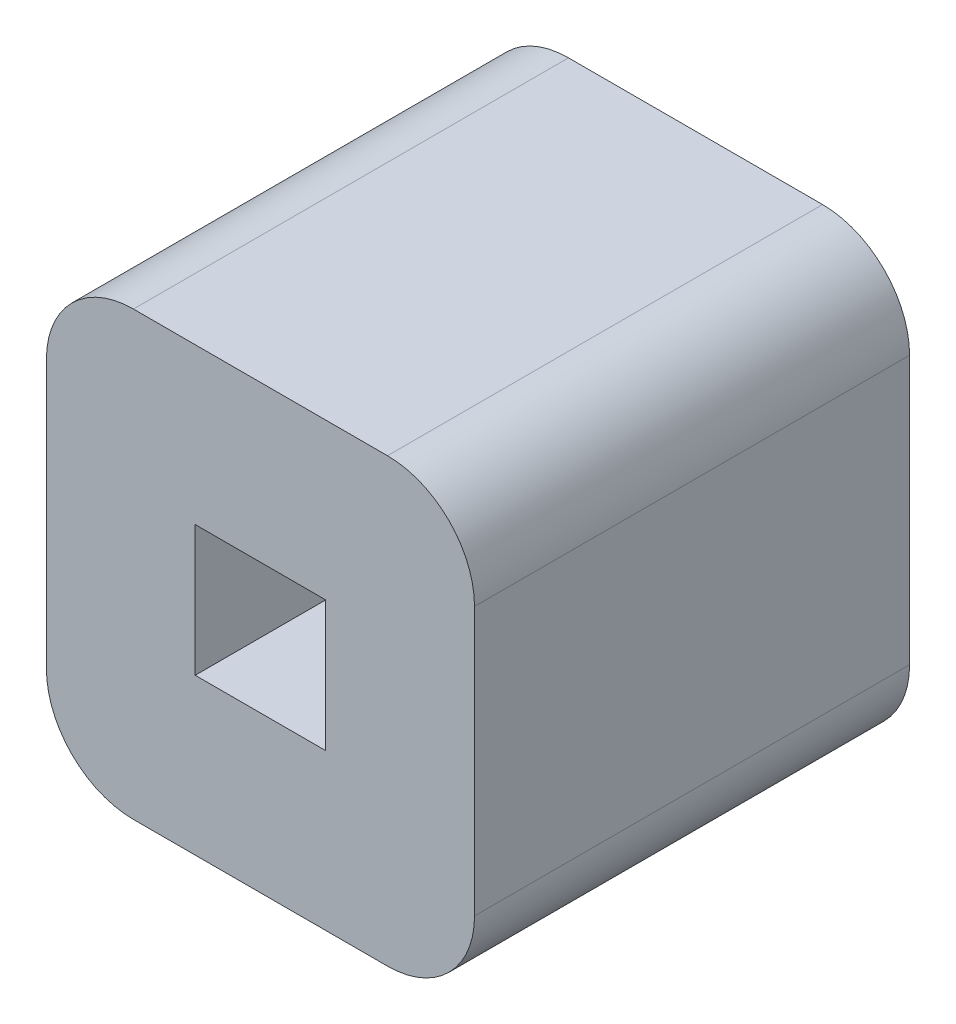
ISO-10303-21;
HEADER;
FILE_DESCRIPTION(('STEP AP214'),'2;1');
FILE_NAME('part.step','',(''),(''),'','','');
FILE_SCHEMA(('AUTOMOTIVE_DESIGN { 1 0 10303 214 1 1 1 1 }'));
ENDSEC;
DATA;
#1=APPLICATION_CONTEXT('core data for automotive mechanical design processes');
#2=APPLICATION_PROTOCOL_DEFINITION('international standard','automotive_design',2000,#1);
#3=PRODUCT_CONTEXT('',#1,'mechanical');
#4=PRODUCT('Part','Part','',(#3));
#5=PRODUCT_RELATED_PRODUCT_CATEGORY('part','',(#4));
#6=PRODUCT_DEFINITION_FORMATION('','',#4);
#7=PRODUCT_DEFINITION_CONTEXT('part definition',#1,'design');
#8=PRODUCT_DEFINITION('design','',#6,#7);
#9=PRODUCT_DEFINITION_SHAPE('','',#8);
#10=(LENGTH_UNIT() NAMED_UNIT(*) SI_UNIT(.MILLI.,.METRE.));
#11=(NAMED_UNIT(*) PLANE_ANGLE_UNIT() SI_UNIT($,.RADIAN.));
#12=(NAMED_UNIT(*) SI_UNIT($,.STERADIAN.) SOLID_ANGLE_UNIT());
#13=UNCERTAINTY_MEASURE_WITH_UNIT(LENGTH_MEASURE(1.E-05),#10,'distance_accuracy_value','');
#14=(GEOMETRIC_REPRESENTATION_CONTEXT(3) GLOBAL_UNCERTAINTY_ASSIGNED_CONTEXT((#13)) GLOBAL_UNIT_ASSIGNED_CONTEXT((#10,
#11,#12)) REPRESENTATION_CONTEXT('',''));
#15=CARTESIAN_POINT('',(0.,0.,0.));
#16=DIRECTION('',(0.,0.,1.));
#17=DIRECTION('',(1.,0.,0.));
#18=AXIS2_PLACEMENT_3D('',#15,#16,#17);
#19=CARTESIAN_POINT('',(1.5403288535176,-0.579832143277619,0.16340157480315));
#20=DIRECTION('',(0.,0.,-1.));
#21=DIRECTION('',(-1.,0.,0.));
#22=AXIS2_PLACEMENT_3D('',#19,#20,#21);
#23=PLANE('',#22);
#24=CARTESIAN_POINT('',(1.41080129446248,-0.565147103907541,0.16340157480315));
#25=DIRECTION('',(0.,0.,1.));
#26=DIRECTION('',(1.,0.,0.));
#27=AXIS2_PLACEMENT_3D('',#24,#25,#26);
#28=CIRCLE('',#27,0.0196850393700787);
#29=CARTESIAN_POINT('',(1.43048633383256,-0.565147103907541,0.16340157480315));
#30=VERTEX_POINT('',#29);
#31=CARTESIAN_POINT('',(1.41080129446248,-0.58483214327762,0.16340157480315));
#32=VERTEX_POINT('',#31);
#33=EDGE_CURVE('E159',#30,#32,#28,.F.);
#34=ORIENTED_EDGE('',*,*,#33,.F.);
#35=DIRECTION('',(0.,-1.,0.));
#36=VECTOR('',#35,1.);
#37=CARTESIAN_POINT('',(1.43048633383256,-0.501485686584706,0.16340157480315));
#38=LINE('',#37,#36);
#39=CARTESIAN_POINT('',(1.43048633383256,-0.504517182647699,0.16340157480315));
#40=VERTEX_POINT('',#39);
#41=EDGE_CURVE('E134',#30,#40,#38,.F.);
#42=ORIENTED_EDGE('',*,*,#41,.T.);
#43=CARTESIAN_POINT('',(1.41080129446248,-0.504517182647699,0.16340157480315));
#44=DIRECTION('',(0.,0.,1.));
#45=DIRECTION('',(1.,0.,0.));
#46=AXIS2_PLACEMENT_3D('',#43,#44,#45);
#47=CIRCLE('',#46,0.0196850393700787);
#48=CARTESIAN_POINT('',(1.41080129446248,-0.48483214327762,0.16340157480315));
#49=VERTEX_POINT('',#48);
#50=EDGE_CURVE('E137',#49,#40,#47,.F.);
#51=ORIENTED_EDGE('',*,*,#50,.F.);
#52=DIRECTION('',(1.,0.,0.));
#53=VECTOR('',#52,1.);
#54=CARTESIAN_POINT('',(1.24544696375382,-0.48483214327762,0.16340157480315));
#55=LINE('',#54,#53);
#56=CARTESIAN_POINT('',(1.35332097950185,-0.48483214327762,0.16340157480315));
#57=VERTEX_POINT('',#56);
#58=EDGE_CURVE('E138',#49,#57,#55,.F.);
#59=ORIENTED_EDGE('',*,*,#58,.T.);
#60=CARTESIAN_POINT('',(1.35332097950185,-0.504517182647699,0.16340157480315));
#61=DIRECTION('',(0.,0.,-1.));
#62=DIRECTION('',(-1.,0.,0.));
#63=AXIS2_PLACEMENT_3D('',#60,#61,#62);
#64=CIRCLE('',#63,0.0196850393700787);
#65=CARTESIAN_POINT('',(1.33363594013177,-0.504517182647699,0.16340157480315));
#66=VERTEX_POINT('',#65);
#67=EDGE_CURVE('E164',#66,#57,#64,.T.);
#68=ORIENTED_EDGE('',*,*,#67,.F.);
#69=DIRECTION('',(0.,-1.,0.));
#70=VECTOR('',#69,1.);
#71=CARTESIAN_POINT('',(1.33363594013177,-0.501485686584706,0.16340157480315));
#72=LINE('',#71,#70);
#73=CARTESIAN_POINT('',(1.33363594013177,-0.565147103907541,0.16340157480315));
#74=VERTEX_POINT('',#73);
#75=EDGE_CURVE('E143',#74,#66,#72,.F.);
#76=ORIENTED_EDGE('',*,*,#75,.F.);
#77=CARTESIAN_POINT('',(1.35332097950185,-0.565147103907541,0.16340157480315));
#78=DIRECTION('',(0.,0.,-1.));
#79=DIRECTION('',(-1.,0.,0.));
#80=AXIS2_PLACEMENT_3D('',#77,#78,#79);
#81=CIRCLE('',#80,0.0196850393700787);
#82=CARTESIAN_POINT('',(1.35332097950185,-0.58483214327762,0.16340157480315));
#83=VERTEX_POINT('',#82);
#84=EDGE_CURVE('E20',#83,#74,#81,.T.);
#85=ORIENTED_EDGE('',*,*,#84,.F.);
#86=DIRECTION('',(-1.,0.,0.));
#87=VECTOR('',#86,1.);
#88=CARTESIAN_POINT('',(1.38206113698216,-0.58483214327762,0.16340157480315));
#89=LINE('',#88,#87);
#90=EDGE_CURVE('E84',#83,#32,#89,.F.);
#91=ORIENTED_EDGE('',*,*,#90,.T.);
#92=EDGE_LOOP('',(#34,#42,#51,#59,#68,#76,#85,#91));
#93=FACE_BOUND('',#92,.T.);
#94=DIRECTION('',(1.,0.,0.));
#95=VECTOR('',#94,1.);
#96=CARTESIAN_POINT('',(1.36582097950185,-0.549595922805179,0.16340157480315));
#97=LINE('',#96,#95);
#98=CARTESIAN_POINT('',(1.39682491650972,-0.549595922805179,0.16340157480315));
#99=VERTEX_POINT('',#98);
#100=CARTESIAN_POINT('',(1.3672973574546,-0.549595922805179,0.16340157480315));
#101=VERTEX_POINT('',#100);
#102=EDGE_CURVE('E94',#99,#101,#97,.F.);
#103=ORIENTED_EDGE('',*,*,#102,.T.);
#104=DIRECTION('',(0.,1.,0.));
#105=VECTOR('',#104,1.);
#106=CARTESIAN_POINT('',(1.3672973574546,-0.551072300757935,0.16340157480315));
#107=LINE('',#106,#105);
#108=CARTESIAN_POINT('',(1.3672973574546,-0.52006836375006,0.16340157480315));
#109=VERTEX_POINT('',#108);
#110=EDGE_CURVE('E110',#109,#101,#107,.F.);
#111=ORIENTED_EDGE('',*,*,#110,.F.);
#112=DIRECTION('',(-1.,0.,0.));
#113=VECTOR('',#112,1.);
#114=CARTESIAN_POINT('',(1.39830129446248,-0.52006836375006,0.16340157480315));
#115=LINE('',#114,#113);
#116=CARTESIAN_POINT('',(1.39682491650972,-0.52006836375006,0.16340157480315));
#117=VERTEX_POINT('',#116);
#118=EDGE_CURVE('E106',#109,#117,#115,.F.);
#119=ORIENTED_EDGE('',*,*,#118,.T.);
#120=DIRECTION('',(0.,1.,0.));
#121=VECTOR('',#120,1.);
#122=CARTESIAN_POINT('',(1.39682491650972,-0.551072300757935,0.16340157480315));
#123=LINE('',#122,#121);
#124=EDGE_CURVE('E108',#117,#99,#123,.F.);
#125=ORIENTED_EDGE('',*,*,#124,.T.);
#126=EDGE_LOOP('',(#103,#111,#119,#125));
#127=FACE_BOUND('',#126,.T.);
#128=ADVANCED_FACE('F17',(#93,#127),#23,.F.);
#129=CARTESIAN_POINT('',(1.39682491650972,-0.551072300757935,0.152181102362205));
#130=DIRECTION('',(1.,0.,0.));
#131=DIRECTION('',(0.,1.,0.));
#132=AXIS2_PLACEMENT_3D('',#129,#130,#131);
#133=PLANE('',#132);
#134=DIRECTION('',(0.,0.,1.));
#135=VECTOR('',#134,1.);
#136=CARTESIAN_POINT('',(1.39682491650972,-0.549595922805179,0.152181102362205));
#137=LINE('',#136,#135);
#138=CARTESIAN_POINT('',(1.39682491650972,-0.549595922805179,0.0649763779527558));
#139=VERTEX_POINT('',#138);
#140=EDGE_CURVE('E120',#139,#99,#137,.T.);
#141=ORIENTED_EDGE('',*,*,#140,.T.);
#142=ORIENTED_EDGE('',*,*,#124,.F.);
#143=DIRECTION('',(0.,0.,1.));
#144=VECTOR('',#143,1.);
#145=CARTESIAN_POINT('',(1.39682491650972,-0.52006836375006,0.152181102362205));
#146=LINE('',#145,#144);
#147=CARTESIAN_POINT('',(1.39682491650972,-0.52006836375006,0.0649763779527558));
#148=VERTEX_POINT('',#147);
#149=EDGE_CURVE('E112',#117,#148,#146,.F.);
#150=ORIENTED_EDGE('',*,*,#149,.T.);
#151=DIRECTION('',(0.,1.,0.));
#152=VECTOR('',#151,1.);
#153=CARTESIAN_POINT('',(1.39682491650972,-0.579832143277619,0.0649763779527558));
#154=LINE('',#153,#152);
#155=EDGE_CURVE('E197',#139,#148,#154,.T.);
#156=ORIENTED_EDGE('',*,*,#155,.F.);
#157=EDGE_LOOP('',(#141,#142,#150,#156));
#158=FACE_BOUND('',#157,.T.);
#159=ADVANCED_FACE('F116',(#158),#133,.F.);
#160=CARTESIAN_POINT('',(1.39830129446248,-0.52006836375006,0.152181102362205));
#161=DIRECTION('',(0.,1.,0.));
#162=DIRECTION('',(-1.,0.,0.));
#163=AXIS2_PLACEMENT_3D('',#160,#161,#162);
#164=PLANE('',#163);
#165=ORIENTED_EDGE('',*,*,#149,.F.);
#166=ORIENTED_EDGE('',*,*,#118,.F.);
#167=DIRECTION('',(0.,0.,1.));
#168=VECTOR('',#167,1.);
#169=CARTESIAN_POINT('',(1.3672973574546,-0.52006836375006,0.152181102362205));
#170=LINE('',#169,#168);
#171=CARTESIAN_POINT('',(1.3672973574546,-0.52006836375006,0.0649763779527558));
#172=VERTEX_POINT('',#171);
#173=EDGE_CURVE('E126',#172,#109,#170,.T.);
#174=ORIENTED_EDGE('',*,*,#173,.F.);
#175=DIRECTION('',(-1.,0.,0.));
#176=VECTOR('',#175,1.);
#177=CARTESIAN_POINT('',(1.5403288535176,-0.52006836375006,0.0649763779527558));
#178=LINE('',#177,#176);
#179=EDGE_CURVE('E124',#148,#172,#178,.T.);
#180=ORIENTED_EDGE('',*,*,#179,.F.);
#181=EDGE_LOOP('',(#165,#166,#174,#180));
#182=FACE_BOUND('',#181,.T.);
#183=ADVANCED_FACE('F122',(#182),#164,.F.);
#184=CARTESIAN_POINT('',(1.3672973574546,-0.551072300757935,0.152181102362205));
#185=DIRECTION('',(1.,0.,0.));
#186=DIRECTION('',(0.,1.,0.));
#187=AXIS2_PLACEMENT_3D('',#184,#185,#186);
#188=PLANE('',#187);
#189=ORIENTED_EDGE('',*,*,#110,.T.);
#190=DIRECTION('',(0.,0.,1.));
#191=VECTOR('',#190,1.);
#192=CARTESIAN_POINT('',(1.3672973574546,-0.549595922805179,0.152181102362205));
#193=LINE('',#192,#191);
#194=CARTESIAN_POINT('',(1.3672973574546,-0.549595922805179,0.0649763779527558));
#195=VERTEX_POINT('',#194);
#196=EDGE_CURVE('E133',#101,#195,#193,.F.);
#197=ORIENTED_EDGE('',*,*,#196,.T.);
#198=DIRECTION('',(0.,1.,0.));
#199=VECTOR('',#198,1.);
#200=CARTESIAN_POINT('',(1.3672973574546,-0.579832143277619,0.0649763779527558));
#201=LINE('',#200,#199);
#202=EDGE_CURVE('E193',#172,#195,#201,.F.);
#203=ORIENTED_EDGE('',*,*,#202,.F.);
#204=ORIENTED_EDGE('',*,*,#173,.T.);
#205=EDGE_LOOP('',(#189,#197,#203,#204));
#206=FACE_BOUND('',#205,.T.);
#207=ADVANCED_FACE('F182',(#206),#188,.T.);
#208=CARTESIAN_POINT('',(1.36582097950185,-0.549595922805179,0.152181102362205));
#209=DIRECTION('',(0.,-1.,0.));
#210=DIRECTION('',(1.,0.,0.));
#211=AXIS2_PLACEMENT_3D('',#208,#209,#210);
#212=PLANE('',#211);
#213=ORIENTED_EDGE('',*,*,#196,.F.);
#214=ORIENTED_EDGE('',*,*,#102,.F.);
#215=ORIENTED_EDGE('',*,*,#140,.F.);
#216=DIRECTION('',(-1.,0.,0.));
#217=VECTOR('',#216,1.);
#218=CARTESIAN_POINT('',(1.5403288535176,-0.549595922805179,0.0649763779527558));
#219=LINE('',#218,#217);
#220=EDGE_CURVE('E188',#195,#139,#219,.F.);
#221=ORIENTED_EDGE('',*,*,#220,.F.);
#222=EDGE_LOOP('',(#213,#214,#215,#221));
#223=FACE_BOUND('',#222,.T.);
#224=ADVANCED_FACE('F186',(#223),#212,.F.);
#225=CARTESIAN_POINT('',(1.38206113698216,-0.58483214327762,0.114188976377953));
#226=DIRECTION('',(0.,1.,0.));
#227=DIRECTION('',(-1.,0.,0.));
#228=AXIS2_PLACEMENT_3D('',#225,#226,#227);
#229=PLANE('',#228);
#230=DIRECTION('',(0.,0.,1.));
#231=VECTOR('',#230,1.);
#232=CARTESIAN_POINT('',(1.41080129446248,-0.58483214327762,0.168322834645669));
#233=LINE('',#232,#231);
#234=CARTESIAN_POINT('',(1.41080129446248,-0.58483214327762,0.0649763779527558));
#235=VERTEX_POINT('',#234);
#236=EDGE_CURVE('E162',#32,#235,#233,.F.);
#237=ORIENTED_EDGE('',*,*,#236,.F.);
#238=ORIENTED_EDGE('',*,*,#90,.F.);
#239=DIRECTION('',(0.,0.,-1.));
#240=VECTOR('',#239,1.);
#241=CARTESIAN_POINT('',(1.35332097950185,-0.58483214327762,0.168322834645669));
#242=LINE('',#241,#240);
#243=CARTESIAN_POINT('',(1.35332097950185,-0.58483214327762,0.0649763779527558));
#244=VERTEX_POINT('',#243);
#245=EDGE_CURVE('E132',#244,#83,#242,.F.);
#246=ORIENTED_EDGE('',*,*,#245,.F.);
#247=DIRECTION('',(-1.,0.,0.));
#248=VECTOR('',#247,1.);
#249=CARTESIAN_POINT('',(1.5403288535176,-0.58483214327762,0.0649763779527558));
#250=LINE('',#249,#248);
#251=EDGE_CURVE('E158',#235,#244,#250,.T.);
#252=ORIENTED_EDGE('',*,*,#251,.F.);
#253=EDGE_LOOP('',(#237,#238,#246,#252));
#254=FACE_BOUND('',#253,.T.);
#255=ADVANCED_FACE('F227',(#254),#229,.F.);
#256=CARTESIAN_POINT('',(1.35332097950185,-0.565147103907541,0.168322834645669));
#257=DIRECTION('',(0.,0.,-1.));
#258=DIRECTION('',(-1.,0.,0.));
#259=AXIS2_PLACEMENT_3D('',#256,#257,#258);
#260=CYLINDRICAL_SURFACE('',#259,0.0196850393700787);
#261=ORIENTED_EDGE('',*,*,#84,.T.);
#262=DIRECTION('',(0.,0.,1.));
#263=VECTOR('',#262,1.);
#264=CARTESIAN_POINT('',(1.33363594013177,-0.565147103907541,0.0600551181102362));
#265=LINE('',#264,#263);
#266=CARTESIAN_POINT('',(1.33363594013177,-0.565147103907541,0.0649763779527558));
#267=VERTEX_POINT('',#266);
#268=EDGE_CURVE('E145',#267,#74,#265,.T.);
#269=ORIENTED_EDGE('',*,*,#268,.F.);
#270=CARTESIAN_POINT('',(1.35332097950185,-0.565147103907541,0.0649763779527558));
#271=DIRECTION('',(0.,0.,-1.));
#272=DIRECTION('',(-1.,0.,0.));
#273=AXIS2_PLACEMENT_3D('',#270,#271,#272);
#274=CIRCLE('',#273,0.0196850393700787);
#275=EDGE_CURVE('E155',#244,#267,#274,.T.);
#276=ORIENTED_EDGE('',*,*,#275,.F.);
#277=ORIENTED_EDGE('',*,*,#245,.T.);
#278=EDGE_LOOP('',(#261,#269,#276,#277));
#279=FACE_BOUND('',#278,.T.);
#280=ADVANCED_FACE('F250',(#279),#260,.T.);
#281=CARTESIAN_POINT('',(1.33363594013177,-0.501485686584706,0.0600551181102362));
#282=DIRECTION('',(-1.,0.,0.));
#283=DIRECTION('',(0.,-1.,0.));
#284=AXIS2_PLACEMENT_3D('',#281,#282,#283);
#285=PLANE('',#284);
#286=ORIENTED_EDGE('',*,*,#75,.T.);
#287=DIRECTION('',(0.,0.,-1.));
#288=VECTOR('',#287,1.);
#289=CARTESIAN_POINT('',(1.33363594013177,-0.504517182647699,0.168322834645669));
#290=LINE('',#289,#288);
#291=CARTESIAN_POINT('',(1.33363594013177,-0.504517182647699,0.0649763779527558));
#292=VERTEX_POINT('',#291);
#293=EDGE_CURVE('E144',#292,#66,#290,.F.);
#294=ORIENTED_EDGE('',*,*,#293,.F.);
#295=DIRECTION('',(0.,1.,0.));
#296=VECTOR('',#295,1.);
#297=CARTESIAN_POINT('',(1.33363594013177,-0.579832143277619,0.0649763779527558));
#298=LINE('',#297,#296);
#299=EDGE_CURVE('E154',#267,#292,#298,.T.);
#300=ORIENTED_EDGE('',*,*,#299,.F.);
#301=ORIENTED_EDGE('',*,*,#268,.T.);
#302=EDGE_LOOP('',(#286,#294,#300,#301));
#303=FACE_BOUND('',#302,.T.);
#304=ADVANCED_FACE('F247',(#303),#285,.T.);
#305=CARTESIAN_POINT('',(1.35332097950185,-0.504517182647699,0.168322834645669));
#306=DIRECTION('',(0.,0.,-1.));
#307=DIRECTION('',(-1.,0.,0.));
#308=AXIS2_PLACEMENT_3D('',#305,#306,#307);
#309=CYLINDRICAL_SURFACE('',#308,0.0196850393700787);
#310=ORIENTED_EDGE('',*,*,#67,.T.);
#311=DIRECTION('',(0.,0.,1.));
#312=VECTOR('',#311,1.);
#313=CARTESIAN_POINT('',(1.35332097950185,-0.48483214327762,0.0600551181102362));
#314=LINE('',#313,#312);
#315=CARTESIAN_POINT('',(1.35332097950185,-0.48483214327762,0.0649763779527558));
#316=VERTEX_POINT('',#315);
#317=EDGE_CURVE('E142',#57,#316,#314,.F.);
#318=ORIENTED_EDGE('',*,*,#317,.T.);
#319=CARTESIAN_POINT('',(1.35332097950185,-0.504517182647699,0.0649763779527558));
#320=DIRECTION('',(0.,0.,-1.));
#321=DIRECTION('',(-1.,0.,0.));
#322=AXIS2_PLACEMENT_3D('',#319,#320,#321);
#323=CIRCLE('',#322,0.0196850393700787);
#324=EDGE_CURVE('E151',#292,#316,#323,.T.);
#325=ORIENTED_EDGE('',*,*,#324,.F.);
#326=ORIENTED_EDGE('',*,*,#293,.T.);
#327=EDGE_LOOP('',(#310,#318,#325,#326));
#328=FACE_BOUND('',#327,.T.);
#329=ADVANCED_FACE('F244',(#328),#309,.T.);
#330=CARTESIAN_POINT('',(1.24544696375382,-0.48483214327762,0.0600551181102362));
#331=DIRECTION('',(0.,-1.,0.));
#332=DIRECTION('',(1.,0.,0.));
#333=AXIS2_PLACEMENT_3D('',#330,#331,#332);
#334=PLANE('',#333);
#335=DIRECTION('',(0.,0.,1.));
#336=VECTOR('',#335,1.);
#337=CARTESIAN_POINT('',(1.41080129446248,-0.48483214327762,0.168322834645669));
#338=LINE('',#337,#336);
#339=CARTESIAN_POINT('',(1.41080129446248,-0.48483214327762,0.0649763779527558));
#340=VERTEX_POINT('',#339);
#341=EDGE_CURVE('E141',#340,#49,#338,.T.);
#342=ORIENTED_EDGE('',*,*,#341,.F.);
#343=DIRECTION('',(-1.,0.,0.));
#344=VECTOR('',#343,1.);
#345=CARTESIAN_POINT('',(1.5403288535176,-0.48483214327762,0.0649763779527558));
#346=LINE('',#345,#344);
#347=EDGE_CURVE('E150',#316,#340,#346,.F.);
#348=ORIENTED_EDGE('',*,*,#347,.F.);
#349=ORIENTED_EDGE('',*,*,#317,.F.);
#350=ORIENTED_EDGE('',*,*,#58,.F.);
#351=EDGE_LOOP('',(#342,#348,#349,#350));
#352=FACE_BOUND('',#351,.T.);
#353=ADVANCED_FACE('F214',(#352),#334,.F.);
#354=CARTESIAN_POINT('',(1.41080129446248,-0.504517182647699,0.168322834645669));
#355=DIRECTION('',(0.,0.,1.));
#356=DIRECTION('',(1.,0.,0.));
#357=AXIS2_PLACEMENT_3D('',#354,#355,#356);
#358=CYLINDRICAL_SURFACE('',#357,0.0196850393700787);
#359=ORIENTED_EDGE('',*,*,#50,.T.);
#360=DIRECTION('',(0.,0.,1.));
#361=VECTOR('',#360,1.);
#362=CARTESIAN_POINT('',(1.43048633383256,-0.504517182647699,0.0600551181102362));
#363=LINE('',#362,#361);
#364=CARTESIAN_POINT('',(1.43048633383256,-0.504517182647699,0.0649763779527558));
#365=VERTEX_POINT('',#364);
#366=EDGE_CURVE('E136',#40,#365,#363,.F.);
#367=ORIENTED_EDGE('',*,*,#366,.T.);
#368=CARTESIAN_POINT('',(1.41080129446248,-0.504517182647699,0.0649763779527558));
#369=DIRECTION('',(0.,0.,1.));
#370=DIRECTION('',(1.,0.,0.));
#371=AXIS2_PLACEMENT_3D('',#368,#369,#370);
#372=CIRCLE('',#371,0.0196850393700787);
#373=EDGE_CURVE('E147',#340,#365,#372,.F.);
#374=ORIENTED_EDGE('',*,*,#373,.F.);
#375=ORIENTED_EDGE('',*,*,#341,.T.);
#376=EDGE_LOOP('',(#359,#367,#374,#375));
#377=FACE_BOUND('',#376,.T.);
#378=ADVANCED_FACE('F208',(#377),#358,.T.);
#379=CARTESIAN_POINT('',(1.43048633383256,-0.501485686584706,0.0600551181102362));
#380=DIRECTION('',(-1.,0.,0.));
#381=DIRECTION('',(0.,-1.,0.));
#382=AXIS2_PLACEMENT_3D('',#379,#380,#381);
#383=PLANE('',#382);
#384=ORIENTED_EDGE('',*,*,#366,.F.);
#385=ORIENTED_EDGE('',*,*,#41,.F.);
#386=DIRECTION('',(0.,0.,1.));
#387=VECTOR('',#386,1.);
#388=CARTESIAN_POINT('',(1.43048633383256,-0.565147103907541,0.168322834645669));
#389=LINE('',#388,#387);
#390=CARTESIAN_POINT('',(1.43048633383256,-0.565147103907541,0.0649763779527558));
#391=VERTEX_POINT('',#390);
#392=EDGE_CURVE('E35',#391,#30,#389,.T.);
#393=ORIENTED_EDGE('',*,*,#392,.F.);
#394=DIRECTION('',(0.,1.,0.));
#395=VECTOR('',#394,1.);
#396=CARTESIAN_POINT('',(1.43048633383256,-0.579832143277619,0.0649763779527558));
#397=LINE('',#396,#395);
#398=EDGE_CURVE('E26',#365,#391,#397,.F.);
#399=ORIENTED_EDGE('',*,*,#398,.F.);
#400=EDGE_LOOP('',(#384,#385,#393,#399));
#401=FACE_BOUND('',#400,.T.);
#402=ADVANCED_FACE('F218',(#401),#383,.F.);
#403=CARTESIAN_POINT('',(1.41080129446248,-0.565147103907541,0.168322834645669));
#404=DIRECTION('',(0.,0.,1.));
#405=DIRECTION('',(1.,0.,0.));
#406=AXIS2_PLACEMENT_3D('',#403,#404,#405);
#407=CYLINDRICAL_SURFACE('',#406,0.0196850393700787);
#408=ORIENTED_EDGE('',*,*,#33,.T.);
#409=ORIENTED_EDGE('',*,*,#236,.T.);
#410=CARTESIAN_POINT('',(1.41080129446248,-0.565147103907541,0.0649763779527558));
#411=DIRECTION('',(0.,0.,1.));
#412=DIRECTION('',(1.,0.,0.));
#413=AXIS2_PLACEMENT_3D('',#410,#411,#412);
#414=CIRCLE('',#413,0.0196850393700787);
#415=EDGE_CURVE('E11',#391,#235,#414,.F.);
#416=ORIENTED_EDGE('',*,*,#415,.F.);
#417=ORIENTED_EDGE('',*,*,#392,.T.);
#418=EDGE_LOOP('',(#408,#409,#416,#417));
#419=FACE_BOUND('',#418,.T.);
#420=ADVANCED_FACE('F229',(#419),#407,.T.);
#421=CARTESIAN_POINT('',(1.5403288535176,-0.579832143277619,0.0649763779527558));
#422=DIRECTION('',(0.,0.,-1.));
#423=DIRECTION('',(-1.,0.,0.));
#424=AXIS2_PLACEMENT_3D('',#421,#422,#423);
#425=PLANE('',#424);
#426=ORIENTED_EDGE('',*,*,#398,.T.);
#427=ORIENTED_EDGE('',*,*,#415,.T.);
#428=ORIENTED_EDGE('',*,*,#251,.T.);
#429=ORIENTED_EDGE('',*,*,#275,.T.);
#430=ORIENTED_EDGE('',*,*,#299,.T.);
#431=ORIENTED_EDGE('',*,*,#324,.T.);
#432=ORIENTED_EDGE('',*,*,#347,.T.);
#433=ORIENTED_EDGE('',*,*,#373,.T.);
#434=EDGE_LOOP('',(#426,#427,#428,#429,#430,#431,#432,#433));
#435=FACE_BOUND('',#434,.T.);
#436=ORIENTED_EDGE('',*,*,#202,.T.);
#437=ORIENTED_EDGE('',*,*,#220,.T.);
#438=ORIENTED_EDGE('',*,*,#155,.T.);
#439=ORIENTED_EDGE('',*,*,#179,.T.);
#440=EDGE_LOOP('',(#436,#437,#438,#439));
#441=FACE_BOUND('',#440,.T.);
#442=ADVANCED_FACE('F195',(#435,#441),#425,.T.);
#443=CLOSED_SHELL('',(#128,#159,#183,#207,#224,#255,#280,#304,#329,#353,#378,#402,#420,#442));
#444=MANIFOLD_SOLID_BREP('B1',#443);
#445=ADVANCED_BREP_SHAPE_REPRESENTATION('',(#18,#444),#14);
#446=SHAPE_DEFINITION_REPRESENTATION(#9,#445);
ENDSEC;
END-ISO-10303-21;
